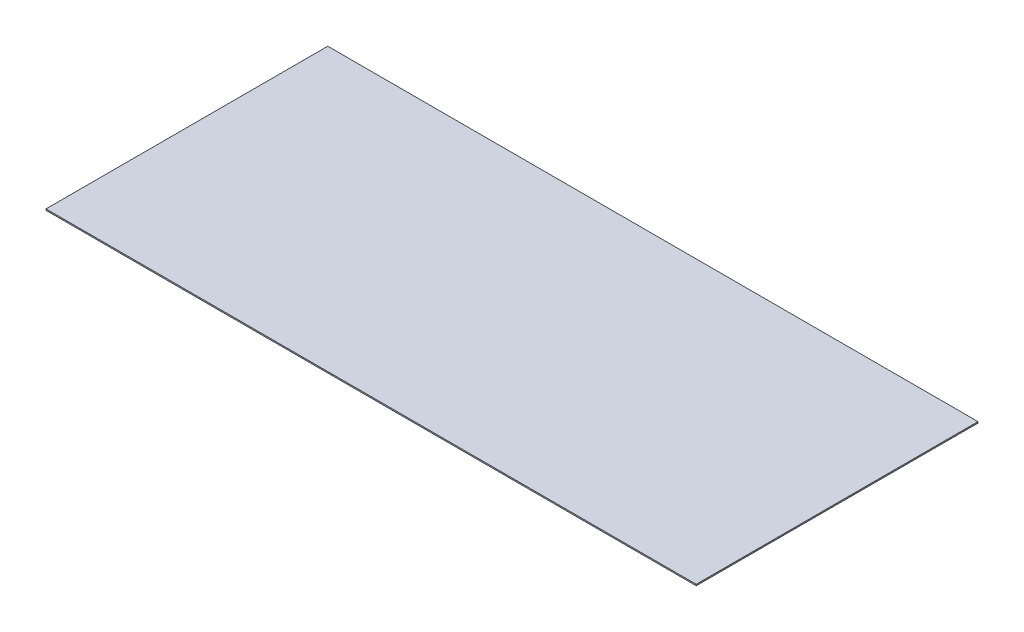
ISO-10303-21;
HEADER;
FILE_DESCRIPTION(('STEP AP214'),'2;1');
FILE_NAME('part.step','',(''),(''),'','','');
FILE_SCHEMA(('AUTOMOTIVE_DESIGN { 1 0 10303 214 1 1 1 1 }'));
ENDSEC;
DATA;
#1=APPLICATION_CONTEXT('core data for automotive mechanical design processes');
#2=APPLICATION_PROTOCOL_DEFINITION('international standard','automotive_design',2000,#1);
#3=PRODUCT_CONTEXT('',#1,'mechanical');
#4=PRODUCT('Part','Part','',(#3));
#5=PRODUCT_RELATED_PRODUCT_CATEGORY('part','',(#4));
#6=PRODUCT_DEFINITION_FORMATION('','',#4);
#7=PRODUCT_DEFINITION_CONTEXT('part definition',#1,'design');
#8=PRODUCT_DEFINITION('design','',#6,#7);
#9=PRODUCT_DEFINITION_SHAPE('','',#8);
#10=(LENGTH_UNIT() NAMED_UNIT(*) SI_UNIT(.MILLI.,.METRE.));
#11=(NAMED_UNIT(*) PLANE_ANGLE_UNIT() SI_UNIT($,.RADIAN.));
#12=(NAMED_UNIT(*) SI_UNIT($,.STERADIAN.) SOLID_ANGLE_UNIT());
#13=UNCERTAINTY_MEASURE_WITH_UNIT(LENGTH_MEASURE(1.E-05),#10,'distance_accuracy_value','');
#14=(GEOMETRIC_REPRESENTATION_CONTEXT(3) GLOBAL_UNCERTAINTY_ASSIGNED_CONTEXT((#13)) GLOBAL_UNIT_ASSIGNED_CONTEXT((#10,
#11,#12)) REPRESENTATION_CONTEXT('',''));
#15=CARTESIAN_POINT('',(0.,0.,0.));
#16=DIRECTION('',(0.,0.,1.));
#17=DIRECTION('',(1.,0.,0.));
#18=AXIS2_PLACEMENT_3D('',#15,#16,#17);
#19=CARTESIAN_POINT('',(-300.,-1.2,130.));
#20=DIRECTION('',(-1.,0.,0.));
#21=DIRECTION('',(0.,0.,1.));
#22=AXIS2_PLACEMENT_3D('',#19,#20,#21);
#23=PLANE('',#22);
#24=DIRECTION('',(0.,0.,1.));
#25=VECTOR('',#24,1.);
#26=CARTESIAN_POINT('',(-300.,0.,130.));
#27=LINE('',#26,#25);
#28=CARTESIAN_POINT('',(-300.,0.,-130.));
#29=VERTEX_POINT('',#28);
#30=CARTESIAN_POINT('',(-300.,0.,130.));
#31=VERTEX_POINT('',#30);
#32=EDGE_CURVE('E107',#29,#31,#27,.T.);
#33=ORIENTED_EDGE('',*,*,#32,.F.);
#34=DIRECTION('',(0.,1.,0.));
#35=VECTOR('',#34,1.);
#36=CARTESIAN_POINT('',(-300.,-1.2,-130.));
#37=LINE('',#36,#35);
#38=CARTESIAN_POINT('',(-300.,-1.2,-130.));
#39=VERTEX_POINT('',#38);
#40=EDGE_CURVE('E11',#39,#29,#37,.T.);
#41=ORIENTED_EDGE('',*,*,#40,.F.);
#42=DIRECTION('',(0.,0.,1.));
#43=VECTOR('',#42,1.);
#44=CARTESIAN_POINT('',(-300.,-1.2,130.));
#45=LINE('',#44,#43);
#46=CARTESIAN_POINT('',(-300.,-1.2,130.));
#47=VERTEX_POINT('',#46);
#48=EDGE_CURVE('E101',#39,#47,#45,.T.);
#49=ORIENTED_EDGE('',*,*,#48,.T.);
#50=DIRECTION('',(0.,1.,0.));
#51=VECTOR('',#50,1.);
#52=CARTESIAN_POINT('',(-300.,-1.2,130.));
#53=LINE('',#52,#51);
#54=EDGE_CURVE('E46',#47,#31,#53,.T.);
#55=ORIENTED_EDGE('',*,*,#54,.T.);
#56=EDGE_LOOP('',(#33,#41,#49,#55));
#57=FACE_BOUND('',#56,.T.);
#58=ADVANCED_FACE('F43',(#57),#23,.T.);
#59=CARTESIAN_POINT('',(300.,-1.2,-130.));
#60=DIRECTION('',(0.,0.,-1.));
#61=DIRECTION('',(-1.,0.,0.));
#62=AXIS2_PLACEMENT_3D('',#59,#60,#61);
#63=PLANE('',#62);
#64=DIRECTION('',(-1.,0.,0.));
#65=VECTOR('',#64,1.);
#66=CARTESIAN_POINT('',(300.,0.,-130.));
#67=LINE('',#66,#65);
#68=CARTESIAN_POINT('',(300.,0.,-130.));
#69=VERTEX_POINT('',#68);
#70=EDGE_CURVE('E103',#69,#29,#67,.T.);
#71=ORIENTED_EDGE('',*,*,#70,.F.);
#72=DIRECTION('',(0.,1.,0.));
#73=VECTOR('',#72,1.);
#74=CARTESIAN_POINT('',(300.,-1.2,-130.));
#75=LINE('',#74,#73);
#76=CARTESIAN_POINT('',(300.,-1.2,-130.));
#77=VERTEX_POINT('',#76);
#78=EDGE_CURVE('E52',#77,#69,#75,.T.);
#79=ORIENTED_EDGE('',*,*,#78,.F.);
#80=DIRECTION('',(-1.,0.,0.));
#81=VECTOR('',#80,1.);
#82=CARTESIAN_POINT('',(300.,-1.2,-130.));
#83=LINE('',#82,#81);
#84=EDGE_CURVE('E98',#77,#39,#83,.T.);
#85=ORIENTED_EDGE('',*,*,#84,.T.);
#86=ORIENTED_EDGE('',*,*,#40,.T.);
#87=EDGE_LOOP('',(#71,#79,#85,#86));
#88=FACE_BOUND('',#87,.T.);
#89=ADVANCED_FACE('F117',(#88),#63,.T.);
#90=CARTESIAN_POINT('',(300.,-1.2,130.));
#91=DIRECTION('',(1.,0.,0.));
#92=DIRECTION('',(0.,0.,-1.));
#93=AXIS2_PLACEMENT_3D('',#90,#91,#92);
#94=PLANE('',#93);
#95=DIRECTION('',(0.,0.,-1.));
#96=VECTOR('',#95,1.);
#97=CARTESIAN_POINT('',(300.,0.,130.));
#98=LINE('',#97,#96);
#99=CARTESIAN_POINT('',(300.,0.,130.));
#100=VERTEX_POINT('',#99);
#101=EDGE_CURVE('E93',#100,#69,#98,.T.);
#102=ORIENTED_EDGE('',*,*,#101,.F.);
#103=DIRECTION('',(0.,1.,0.));
#104=VECTOR('',#103,1.);
#105=CARTESIAN_POINT('',(300.,-1.2,130.));
#106=LINE('',#105,#104);
#107=CARTESIAN_POINT('',(300.,-1.2,130.));
#108=VERTEX_POINT('',#107);
#109=EDGE_CURVE('E88',#108,#100,#106,.T.);
#110=ORIENTED_EDGE('',*,*,#109,.F.);
#111=DIRECTION('',(0.,0.,-1.));
#112=VECTOR('',#111,1.);
#113=CARTESIAN_POINT('',(300.,-1.2,130.));
#114=LINE('',#113,#112);
#115=EDGE_CURVE('E91',#108,#77,#114,.T.);
#116=ORIENTED_EDGE('',*,*,#115,.T.);
#117=ORIENTED_EDGE('',*,*,#78,.T.);
#118=EDGE_LOOP('',(#102,#110,#116,#117));
#119=FACE_BOUND('',#118,.T.);
#120=ADVANCED_FACE('F90',(#119),#94,.T.);
#121=CARTESIAN_POINT('',(300.,-1.2,130.));
#122=DIRECTION('',(0.,0.,1.));
#123=DIRECTION('',(1.,0.,0.));
#124=AXIS2_PLACEMENT_3D('',#121,#122,#123);
#125=PLANE('',#124);
#126=DIRECTION('',(1.,0.,0.));
#127=VECTOR('',#126,1.);
#128=CARTESIAN_POINT('',(300.,0.,130.));
#129=LINE('',#128,#127);
#130=EDGE_CURVE('E110',#31,#100,#129,.T.);
#131=ORIENTED_EDGE('',*,*,#130,.F.);
#132=ORIENTED_EDGE('',*,*,#54,.F.);
#133=DIRECTION('',(1.,0.,0.));
#134=VECTOR('',#133,1.);
#135=CARTESIAN_POINT('',(300.,-1.2,130.));
#136=LINE('',#135,#134);
#137=EDGE_CURVE('E97',#47,#108,#136,.T.);
#138=ORIENTED_EDGE('',*,*,#137,.T.);
#139=ORIENTED_EDGE('',*,*,#109,.T.);
#140=EDGE_LOOP('',(#131,#132,#138,#139));
#141=FACE_BOUND('',#140,.T.);
#142=ADVANCED_FACE('F100',(#141),#125,.T.);
#143=CARTESIAN_POINT('',(0.,-1.2,0.));
#144=DIRECTION('',(0.,1.,0.));
#145=DIRECTION('',(0.,0.,1.));
#146=AXIS2_PLACEMENT_3D('',#143,#144,#145);
#147=PLANE('',#146);
#148=ORIENTED_EDGE('',*,*,#48,.F.);
#149=ORIENTED_EDGE('',*,*,#84,.F.);
#150=ORIENTED_EDGE('',*,*,#115,.F.);
#151=ORIENTED_EDGE('',*,*,#137,.F.);
#152=EDGE_LOOP('',(#148,#149,#150,#151));
#153=FACE_BOUND('',#152,.T.);
#154=ADVANCED_FACE('F96',(#153),#147,.F.);
#155=CARTESIAN_POINT('',(0.,0.,0.));
#156=DIRECTION('',(0.,1.,0.));
#157=DIRECTION('',(0.,0.,1.));
#158=AXIS2_PLACEMENT_3D('',#155,#156,#157);
#159=PLANE('',#158);
#160=ORIENTED_EDGE('',*,*,#32,.T.);
#161=ORIENTED_EDGE('',*,*,#130,.T.);
#162=ORIENTED_EDGE('',*,*,#101,.T.);
#163=ORIENTED_EDGE('',*,*,#70,.T.);
#164=EDGE_LOOP('',(#160,#161,#162,#163));
#165=FACE_BOUND('',#164,.T.);
#166=ADVANCED_FACE('F116',(#165),#159,.T.);
#167=CLOSED_SHELL('',(#58,#89,#120,#142,#154,#166));
#168=MANIFOLD_SOLID_BREP('B2',#167);
#169=ADVANCED_BREP_SHAPE_REPRESENTATION('',(#18,#168),#14);
#170=SHAPE_DEFINITION_REPRESENTATION(#9,#169);
ENDSEC;
END-ISO-10303-21;
